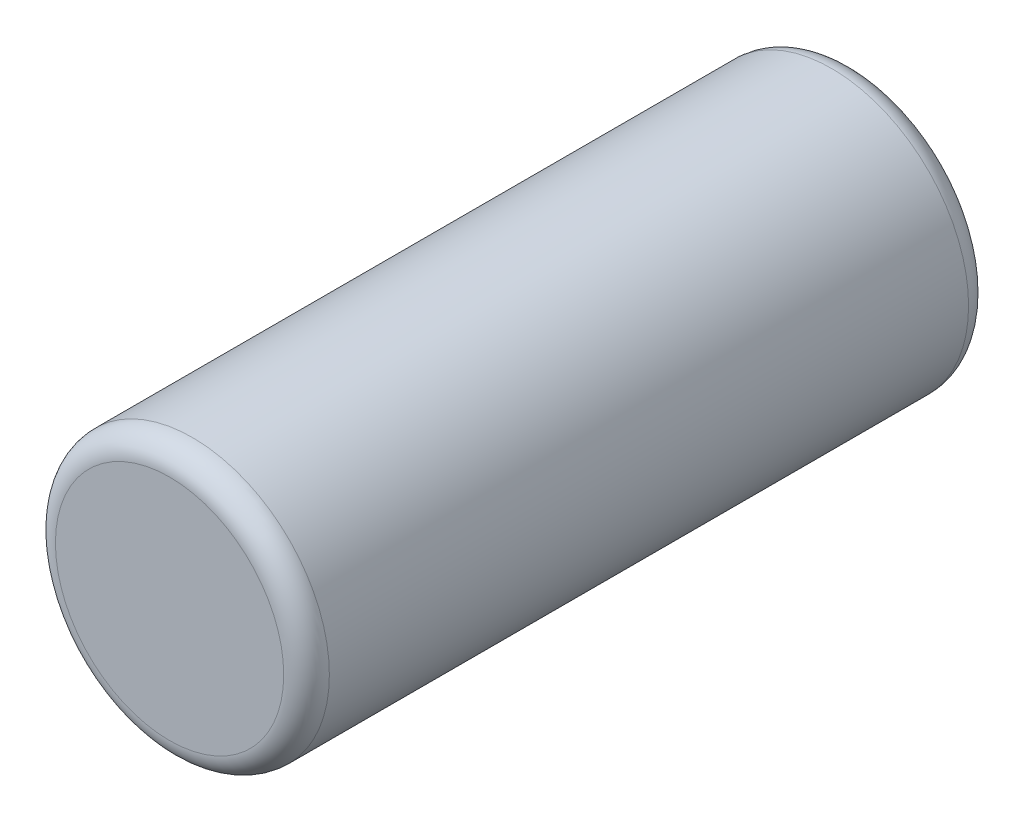
ISO-10303-21;
HEADER;
FILE_DESCRIPTION(('STEP AP214'),'2;1');
FILE_NAME('part.step','',(''),(''),'','','');
FILE_SCHEMA(('AUTOMOTIVE_DESIGN { 1 0 10303 214 1 1 1 1 }'));
ENDSEC;
DATA;
#1=APPLICATION_CONTEXT('core data for automotive mechanical design processes');
#2=APPLICATION_PROTOCOL_DEFINITION('international standard','automotive_design',2000,#1);
#3=PRODUCT_CONTEXT('',#1,'mechanical');
#4=PRODUCT('Part','Part','',(#3));
#5=PRODUCT_RELATED_PRODUCT_CATEGORY('part','',(#4));
#6=PRODUCT_DEFINITION_FORMATION('','',#4);
#7=PRODUCT_DEFINITION_CONTEXT('part definition',#1,'design');
#8=PRODUCT_DEFINITION('design','',#6,#7);
#9=PRODUCT_DEFINITION_SHAPE('','',#8);
#10=(LENGTH_UNIT() NAMED_UNIT(*) SI_UNIT(.MILLI.,.METRE.));
#11=(NAMED_UNIT(*) PLANE_ANGLE_UNIT() SI_UNIT($,.RADIAN.));
#12=(NAMED_UNIT(*) SI_UNIT($,.STERADIAN.) SOLID_ANGLE_UNIT());
#13=UNCERTAINTY_MEASURE_WITH_UNIT(LENGTH_MEASURE(1.E-05),#10,'distance_accuracy_value','');
#14=(GEOMETRIC_REPRESENTATION_CONTEXT(3) GLOBAL_UNCERTAINTY_ASSIGNED_CONTEXT((#13)) GLOBAL_UNIT_ASSIGNED_CONTEXT((#10,
#11,#12)) REPRESENTATION_CONTEXT('',''));
#15=CARTESIAN_POINT('',(0.,0.,0.));
#16=DIRECTION('',(0.,0.,1.));
#17=DIRECTION('',(1.,0.,0.));
#18=AXIS2_PLACEMENT_3D('',#15,#16,#17);
#19=CARTESIAN_POINT('',(0.,0.,30.));
#20=DIRECTION('',(0.,0.,-1.));
#21=DIRECTION('',(-1.,0.,0.));
#22=AXIS2_PLACEMENT_3D('',#19,#20,#21);
#23=CYLINDRICAL_SURFACE('',#22,6.);
#24=CARTESIAN_POINT('',(0.,0.,1.));
#25=DIRECTION('',(0.,0.,1.));
#26=DIRECTION('',(1.,0.,0.));
#27=AXIS2_PLACEMENT_3D('',#24,#25,#26);
#28=CIRCLE('',#27,6.);
#29=CARTESIAN_POINT('',(6.,0.,1.));
#30=VERTEX_POINT('',#29);
#31=EDGE_CURVE('E41',#30,#30,#28,.T.);
#32=ORIENTED_EDGE('',*,*,#31,.T.);
#33=EDGE_LOOP('',(#32));
#34=FACE_BOUND('',#33,.T.);
#35=CARTESIAN_POINT('',(0.,0.,29.));
#36=DIRECTION('',(0.,0.,1.));
#37=DIRECTION('',(1.,0.,0.));
#38=AXIS2_PLACEMENT_3D('',#35,#36,#37);
#39=CIRCLE('',#38,6.);
#40=CARTESIAN_POINT('',(6.,0.,29.));
#41=VERTEX_POINT('',#40);
#42=EDGE_CURVE('E45',#41,#41,#39,.F.);
#43=ORIENTED_EDGE('',*,*,#42,.T.);
#44=EDGE_LOOP('',(#43));
#45=FACE_BOUND('',#44,.T.);
#46=ADVANCED_FACE('F30',(#34,#45),#23,.T.);
#47=CARTESIAN_POINT('',(0.,0.,30.));
#48=DIRECTION('',(0.,0.,1.));
#49=DIRECTION('',(1.,0.,0.));
#50=AXIS2_PLACEMENT_3D('',#47,#48,#49);
#51=PLANE('',#50);
#52=CARTESIAN_POINT('',(0.,0.,30.));
#53=DIRECTION('',(0.,0.,1.));
#54=DIRECTION('',(1.,0.,0.));
#55=AXIS2_PLACEMENT_3D('',#52,#53,#54);
#56=CIRCLE('',#55,5.);
#57=CARTESIAN_POINT('',(5.,0.,30.));
#58=VERTEX_POINT('',#57);
#59=EDGE_CURVE('E10',#58,#58,#56,.T.);
#60=ORIENTED_EDGE('',*,*,#59,.T.);
#61=EDGE_LOOP('',(#60));
#62=FACE_BOUND('',#61,.T.);
#63=ADVANCED_FACE('F61',(#62),#51,.T.);
#64=CARTESIAN_POINT('',(0.,0.,0.));
#65=DIRECTION('',(0.,0.,1.));
#66=DIRECTION('',(1.,0.,0.));
#67=AXIS2_PLACEMENT_3D('',#64,#65,#66);
#68=PLANE('',#67);
#69=CARTESIAN_POINT('',(0.,0.,0.));
#70=DIRECTION('',(0.,0.,1.));
#71=DIRECTION('',(1.,0.,0.));
#72=AXIS2_PLACEMENT_3D('',#69,#70,#71);
#73=CIRCLE('',#72,5.);
#74=CARTESIAN_POINT('',(5.,0.,0.));
#75=VERTEX_POINT('',#74);
#76=EDGE_CURVE('E37',#75,#75,#73,.F.);
#77=ORIENTED_EDGE('',*,*,#76,.T.);
#78=EDGE_LOOP('',(#77));
#79=FACE_BOUND('',#78,.T.);
#80=ADVANCED_FACE('F58',(#79),#68,.F.);
#81=CARTESIAN_POINT('',(0.,0.,1.));
#82=DIRECTION('',(0.,0.,1.));
#83=DIRECTION('',(1.,0.,0.));
#84=AXIS2_PLACEMENT_3D('',#81,#82,#83);
#85=TOROIDAL_SURFACE('',#84,5.,1.);
#86=ORIENTED_EDGE('',*,*,#76,.F.);
#87=EDGE_LOOP('',(#86));
#88=FACE_BOUND('',#87,.T.);
#89=ORIENTED_EDGE('',*,*,#31,.F.);
#90=EDGE_LOOP('',(#89));
#91=FACE_BOUND('',#90,.T.);
#92=ADVANCED_FACE('F54',(#88,#91),#85,.T.);
#93=CARTESIAN_POINT('',(0.,0.,29.));
#94=DIRECTION('',(0.,0.,1.));
#95=DIRECTION('',(1.,0.,0.));
#96=AXIS2_PLACEMENT_3D('',#93,#94,#95);
#97=TOROIDAL_SURFACE('',#96,5.,1.);
#98=ORIENTED_EDGE('',*,*,#42,.F.);
#99=EDGE_LOOP('',(#98));
#100=FACE_BOUND('',#99,.T.);
#101=ORIENTED_EDGE('',*,*,#59,.F.);
#102=EDGE_LOOP('',(#101));
#103=FACE_BOUND('',#102,.T.);
#104=ADVANCED_FACE('F32',(#100,#103),#97,.T.);
#105=CLOSED_SHELL('',(#46,#63,#80,#92,#104));
#106=MANIFOLD_SOLID_BREP('B2',#105);
#107=ADVANCED_BREP_SHAPE_REPRESENTATION('',(#18,#106),#14);
#108=SHAPE_DEFINITION_REPRESENTATION(#9,#107);
ENDSEC;
END-ISO-10303-21;
